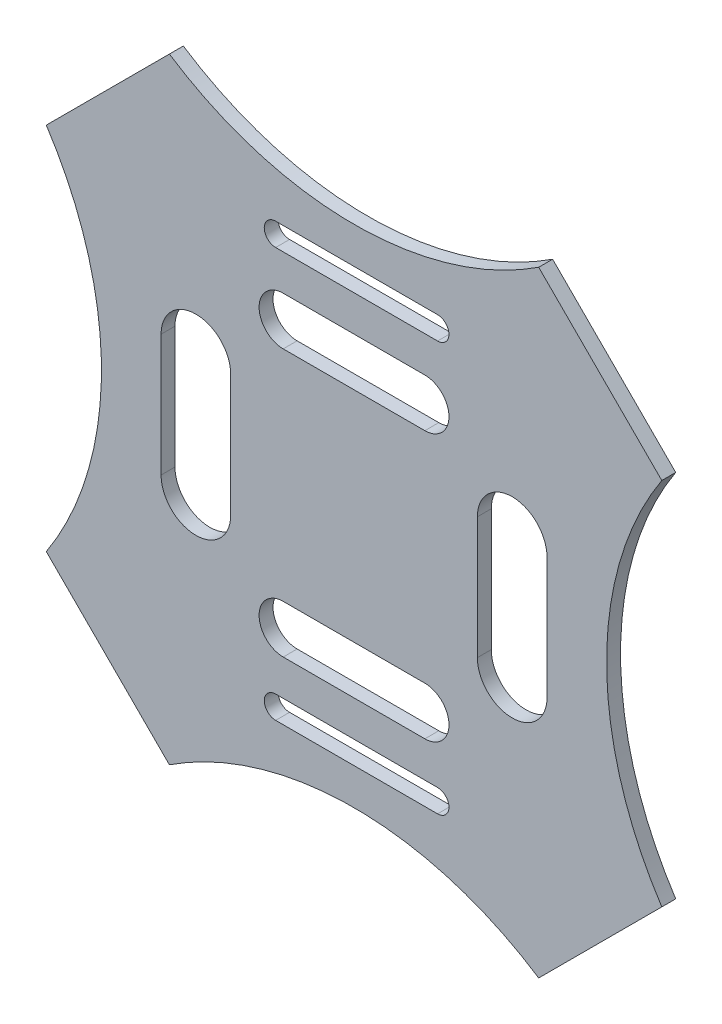
ISO-10303-21;
HEADER;
FILE_DESCRIPTION(('STEP AP214'),'2;1');
FILE_NAME('part.step','',(''),(''),'','','');
FILE_SCHEMA(('AUTOMOTIVE_DESIGN { 1 0 10303 214 1 1 1 1 }'));
ENDSEC;
DATA;
#1=APPLICATION_CONTEXT('core data for automotive mechanical design processes');
#2=APPLICATION_PROTOCOL_DEFINITION('international standard','automotive_design',2000,#1);
#3=PRODUCT_CONTEXT('',#1,'mechanical');
#4=PRODUCT('Part','Part','',(#3));
#5=PRODUCT_RELATED_PRODUCT_CATEGORY('part','',(#4));
#6=PRODUCT_DEFINITION_FORMATION('','',#4);
#7=PRODUCT_DEFINITION_CONTEXT('part definition',#1,'design');
#8=PRODUCT_DEFINITION('design','',#6,#7);
#9=PRODUCT_DEFINITION_SHAPE('','',#8);
#10=(LENGTH_UNIT() NAMED_UNIT(*) SI_UNIT(.MILLI.,.METRE.));
#11=(NAMED_UNIT(*) PLANE_ANGLE_UNIT() SI_UNIT($,.RADIAN.));
#12=(NAMED_UNIT(*) SI_UNIT($,.STERADIAN.) SOLID_ANGLE_UNIT());
#13=UNCERTAINTY_MEASURE_WITH_UNIT(LENGTH_MEASURE(1.E-05),#10,'distance_accuracy_value','');
#14=(GEOMETRIC_REPRESENTATION_CONTEXT(3) GLOBAL_UNCERTAINTY_ASSIGNED_CONTEXT((#13)) GLOBAL_UNIT_ASSIGNED_CONTEXT((#10,
#11,#12)) REPRESENTATION_CONTEXT('',''));
#15=CARTESIAN_POINT('',(0.,0.,0.));
#16=DIRECTION('',(0.,0.,1.));
#17=DIRECTION('',(1.,0.,0.));
#18=AXIS2_PLACEMENT_3D('',#15,#16,#17);
#19=CARTESIAN_POINT('',(0.,84.5998532410874,2.));
#20=DIRECTION('',(0.,0.,-1.));
#21=DIRECTION('',(-1.,0.,0.));
#22=AXIS2_PLACEMENT_3D('',#19,#20,#21);
#23=CYLINDRICAL_SURFACE('',#22,48.3295347499184);
#24=CARTESIAN_POINT('',(0.,84.5998532410874,0.));
#25=DIRECTION('',(0.,0.,1.));
#26=DIRECTION('',(1.,0.,0.));
#27=AXIS2_PLACEMENT_3D('',#24,#25,#26);
#28=CIRCLE('',#27,48.3295347499184);
#29=CARTESIAN_POINT('',(-26.5165042944955,44.1941738241592,0.));
#30=VERTEX_POINT('',#29);
#31=CARTESIAN_POINT('',(26.5165042944955,44.1941738241592,0.));
#32=VERTEX_POINT('',#31);
#33=EDGE_CURVE('E427',#30,#32,#28,.T.);
#34=ORIENTED_EDGE('',*,*,#33,.F.);
#35=DIRECTION('',(0.,0.,-1.));
#36=VECTOR('',#35,1.);
#37=CARTESIAN_POINT('',(-26.5165042944955,44.1941738241592,2.));
#38=LINE('',#37,#36);
#39=CARTESIAN_POINT('',(-26.5165042944955,44.1941738241592,2.));
#40=VERTEX_POINT('',#39);
#41=EDGE_CURVE('E11',#40,#30,#38,.T.);
#42=ORIENTED_EDGE('',*,*,#41,.F.);
#43=CARTESIAN_POINT('',(0.,84.5998532410874,2.));
#44=DIRECTION('',(0.,0.,1.));
#45=DIRECTION('',(1.,0.,0.));
#46=AXIS2_PLACEMENT_3D('',#43,#44,#45);
#47=CIRCLE('',#46,48.3295347499184);
#48=CARTESIAN_POINT('',(26.5165042944955,44.1941738241592,2.));
#49=VERTEX_POINT('',#48);
#50=EDGE_CURVE('E428',#40,#49,#47,.T.);
#51=ORIENTED_EDGE('',*,*,#50,.T.);
#52=DIRECTION('',(0.,0.,-1.));
#53=VECTOR('',#52,1.);
#54=CARTESIAN_POINT('',(26.5165042944955,44.1941738241592,2.));
#55=LINE('',#54,#53);
#56=EDGE_CURVE('E449',#49,#32,#55,.T.);
#57=ORIENTED_EDGE('',*,*,#56,.T.);
#58=EDGE_LOOP('',(#34,#42,#51,#57));
#59=FACE_BOUND('',#58,.T.);
#60=ADVANCED_FACE('F40',(#59),#23,.F.);
#61=CARTESIAN_POINT('',(-35.3553390593274,35.3553390593274,2.));
#62=DIRECTION('',(0.707106781186548,-0.707106781186547,0.));
#63=DIRECTION('',(0.707106781186547,0.707106781186548,0.));
#64=AXIS2_PLACEMENT_3D('',#61,#62,#63);
#65=PLANE('',#64);
#66=DIRECTION('',(-0.707106781186547,-0.707106781186548,0.));
#67=VECTOR('',#66,1.);
#68=CARTESIAN_POINT('',(-35.3553390593274,35.3553390593274,0.));
#69=LINE('',#68,#67);
#70=CARTESIAN_POINT('',(-44.1941738241592,26.5165042944955,0.));
#71=VERTEX_POINT('',#70);
#72=EDGE_CURVE('E452',#30,#71,#69,.T.);
#73=ORIENTED_EDGE('',*,*,#72,.T.);
#74=DIRECTION('',(0.,0.,-1.));
#75=VECTOR('',#74,1.);
#76=CARTESIAN_POINT('',(-44.1941738241592,26.5165042944955,2.));
#77=LINE('',#76,#75);
#78=CARTESIAN_POINT('',(-44.1941738241592,26.5165042944955,2.));
#79=VERTEX_POINT('',#78);
#80=EDGE_CURVE('E47',#79,#71,#77,.T.);
#81=ORIENTED_EDGE('',*,*,#80,.F.);
#82=DIRECTION('',(-0.707106781186547,-0.707106781186548,0.));
#83=VECTOR('',#82,1.);
#84=CARTESIAN_POINT('',(-35.3553390593274,35.3553390593274,2.));
#85=LINE('',#84,#83);
#86=EDGE_CURVE('E431',#40,#79,#85,.T.);
#87=ORIENTED_EDGE('',*,*,#86,.F.);
#88=ORIENTED_EDGE('',*,*,#41,.T.);
#89=EDGE_LOOP('',(#73,#81,#87,#88));
#90=FACE_BOUND('',#89,.T.);
#91=ADVANCED_FACE('F505',(#90),#65,.F.);
#92=CARTESIAN_POINT('',(-84.5998532410874,0.,2.));
#93=DIRECTION('',(0.,0.,-1.));
#94=DIRECTION('',(-1.,0.,0.));
#95=AXIS2_PLACEMENT_3D('',#92,#93,#94);
#96=CYLINDRICAL_SURFACE('',#95,48.3295347499185);
#97=CARTESIAN_POINT('',(-84.5998532410874,0.,0.));
#98=DIRECTION('',(0.,0.,1.));
#99=DIRECTION('',(1.,0.,0.));
#100=AXIS2_PLACEMENT_3D('',#97,#98,#99);
#101=CIRCLE('',#100,48.3295347499185);
#102=CARTESIAN_POINT('',(-44.1941738241592,-26.5165042944955,0.));
#103=VERTEX_POINT('',#102);
#104=EDGE_CURVE('E454',#71,#103,#101,.F.);
#105=ORIENTED_EDGE('',*,*,#104,.T.);
#106=DIRECTION('',(0.,0.,-1.));
#107=VECTOR('',#106,1.);
#108=CARTESIAN_POINT('',(-44.1941738241592,-26.5165042944955,2.));
#109=LINE('',#108,#107);
#110=CARTESIAN_POINT('',(-44.1941738241592,-26.5165042944955,2.));
#111=VERTEX_POINT('',#110);
#112=EDGE_CURVE('E480',#111,#103,#109,.T.);
#113=ORIENTED_EDGE('',*,*,#112,.F.);
#114=CARTESIAN_POINT('',(-84.5998532410874,0.,2.));
#115=DIRECTION('',(0.,0.,1.));
#116=DIRECTION('',(1.,0.,0.));
#117=AXIS2_PLACEMENT_3D('',#114,#115,#116);
#118=CIRCLE('',#117,48.3295347499185);
#119=EDGE_CURVE('E434',#79,#111,#118,.F.);
#120=ORIENTED_EDGE('',*,*,#119,.F.);
#121=ORIENTED_EDGE('',*,*,#80,.T.);
#122=EDGE_LOOP('',(#105,#113,#120,#121));
#123=FACE_BOUND('',#122,.T.);
#124=ADVANCED_FACE('F486',(#123),#96,.F.);
#125=CARTESIAN_POINT('',(-35.3553390593274,-35.3553390593274,2.));
#126=DIRECTION('',(-0.707106781186547,-0.707106781186548,0.));
#127=DIRECTION('',(0.707106781186548,-0.707106781186547,0.));
#128=AXIS2_PLACEMENT_3D('',#125,#126,#127);
#129=PLANE('',#128);
#130=DIRECTION('',(-0.707106781186548,0.707106781186547,0.));
#131=VECTOR('',#130,1.);
#132=CARTESIAN_POINT('',(-35.3553390593274,-35.3553390593274,0.));
#133=LINE('',#132,#131);
#134=CARTESIAN_POINT('',(-26.5165042944955,-44.1941738241592,0.));
#135=VERTEX_POINT('',#134);
#136=EDGE_CURVE('E457',#135,#103,#133,.T.);
#137=ORIENTED_EDGE('',*,*,#136,.F.);
#138=DIRECTION('',(0.,0.,-1.));
#139=VECTOR('',#138,1.);
#140=CARTESIAN_POINT('',(-26.5165042944955,-44.1941738241592,2.));
#141=LINE('',#140,#139);
#142=CARTESIAN_POINT('',(-26.5165042944955,-44.1941738241592,2.));
#143=VERTEX_POINT('',#142);
#144=EDGE_CURVE('E478',#143,#135,#141,.T.);
#145=ORIENTED_EDGE('',*,*,#144,.F.);
#146=DIRECTION('',(-0.707106781186548,0.707106781186547,0.));
#147=VECTOR('',#146,1.);
#148=CARTESIAN_POINT('',(-35.3553390593274,-35.3553390593274,2.));
#149=LINE('',#148,#147);
#150=EDGE_CURVE('E436',#143,#111,#149,.T.);
#151=ORIENTED_EDGE('',*,*,#150,.T.);
#152=ORIENTED_EDGE('',*,*,#112,.T.);
#153=EDGE_LOOP('',(#137,#145,#151,#152));
#154=FACE_BOUND('',#153,.T.);
#155=ADVANCED_FACE('F497',(#154),#129,.T.);
#156=CARTESIAN_POINT('',(0.,-84.5998532410874,2.));
#157=DIRECTION('',(0.,0.,-1.));
#158=DIRECTION('',(-1.,0.,0.));
#159=AXIS2_PLACEMENT_3D('',#156,#157,#158);
#160=CYLINDRICAL_SURFACE('',#159,48.3295347499185);
#161=CARTESIAN_POINT('',(0.,-84.5998532410874,0.));
#162=DIRECTION('',(0.,0.,1.));
#163=DIRECTION('',(1.,0.,0.));
#164=AXIS2_PLACEMENT_3D('',#161,#162,#163);
#165=CIRCLE('',#164,48.3295347499185);
#166=CARTESIAN_POINT('',(26.5165042944955,-44.1941738241592,0.));
#167=VERTEX_POINT('',#166);
#168=EDGE_CURVE('E460',#135,#167,#165,.F.);
#169=ORIENTED_EDGE('',*,*,#168,.T.);
#170=DIRECTION('',(0.,0.,-1.));
#171=VECTOR('',#170,1.);
#172=CARTESIAN_POINT('',(26.5165042944955,-44.1941738241592,2.));
#173=LINE('',#172,#171);
#174=CARTESIAN_POINT('',(26.5165042944955,-44.1941738241592,2.));
#175=VERTEX_POINT('',#174);
#176=EDGE_CURVE('E475',#175,#167,#173,.T.);
#177=ORIENTED_EDGE('',*,*,#176,.F.);
#178=CARTESIAN_POINT('',(0.,-84.5998532410874,2.));
#179=DIRECTION('',(0.,0.,1.));
#180=DIRECTION('',(1.,0.,0.));
#181=AXIS2_PLACEMENT_3D('',#178,#179,#180);
#182=CIRCLE('',#181,48.3295347499185);
#183=EDGE_CURVE('E439',#143,#175,#182,.F.);
#184=ORIENTED_EDGE('',*,*,#183,.F.);
#185=ORIENTED_EDGE('',*,*,#144,.T.);
#186=EDGE_LOOP('',(#169,#177,#184,#185));
#187=FACE_BOUND('',#186,.T.);
#188=ADVANCED_FACE('F519',(#187),#160,.F.);
#189=CARTESIAN_POINT('',(35.3553390593274,-35.3553390593274,2.));
#190=DIRECTION('',(-0.707106781186548,0.707106781186547,0.));
#191=DIRECTION('',(-0.707106781186547,-0.707106781186548,0.));
#192=AXIS2_PLACEMENT_3D('',#189,#190,#191);
#193=PLANE('',#192);
#194=DIRECTION('',(0.707106781186547,0.707106781186548,0.));
#195=VECTOR('',#194,1.);
#196=CARTESIAN_POINT('',(35.3553390593274,-35.3553390593274,0.));
#197=LINE('',#196,#195);
#198=CARTESIAN_POINT('',(44.1941738241592,-26.5165042944955,0.));
#199=VERTEX_POINT('',#198);
#200=EDGE_CURVE('E462',#167,#199,#197,.T.);
#201=ORIENTED_EDGE('',*,*,#200,.T.);
#202=DIRECTION('',(0.,0.,-1.));
#203=VECTOR('',#202,1.);
#204=CARTESIAN_POINT('',(44.1941738241592,-26.5165042944955,2.));
#205=LINE('',#204,#203);
#206=CARTESIAN_POINT('',(44.1941738241592,-26.5165042944955,2.));
#207=VERTEX_POINT('',#206);
#208=EDGE_CURVE('E473',#207,#199,#205,.T.);
#209=ORIENTED_EDGE('',*,*,#208,.F.);
#210=DIRECTION('',(0.707106781186547,0.707106781186548,0.));
#211=VECTOR('',#210,1.);
#212=CARTESIAN_POINT('',(35.3553390593274,-35.3553390593274,2.));
#213=LINE('',#212,#211);
#214=EDGE_CURVE('E441',#175,#207,#213,.T.);
#215=ORIENTED_EDGE('',*,*,#214,.F.);
#216=ORIENTED_EDGE('',*,*,#176,.T.);
#217=EDGE_LOOP('',(#201,#209,#215,#216));
#218=FACE_BOUND('',#217,.T.);
#219=ADVANCED_FACE('F516',(#218),#193,.F.);
#220=CARTESIAN_POINT('',(84.5998532410874,0.,2.));
#221=DIRECTION('',(0.,0.,-1.));
#222=DIRECTION('',(-1.,0.,0.));
#223=AXIS2_PLACEMENT_3D('',#220,#221,#222);
#224=CYLINDRICAL_SURFACE('',#223,48.3295347499184);
#225=CARTESIAN_POINT('',(84.5998532410874,0.,0.));
#226=DIRECTION('',(0.,0.,1.));
#227=DIRECTION('',(1.,0.,0.));
#228=AXIS2_PLACEMENT_3D('',#225,#226,#227);
#229=CIRCLE('',#228,48.3295347499184);
#230=CARTESIAN_POINT('',(44.1941738241592,26.5165042944956,0.));
#231=VERTEX_POINT('',#230);
#232=EDGE_CURVE('E465',#231,#199,#229,.T.);
#233=ORIENTED_EDGE('',*,*,#232,.F.);
#234=DIRECTION('',(0.,0.,-1.));
#235=VECTOR('',#234,1.);
#236=CARTESIAN_POINT('',(44.1941738241592,26.5165042944956,2.));
#237=LINE('',#236,#235);
#238=CARTESIAN_POINT('',(44.1941738241592,26.5165042944956,2.));
#239=VERTEX_POINT('',#238);
#240=EDGE_CURVE('E471',#239,#231,#237,.T.);
#241=ORIENTED_EDGE('',*,*,#240,.F.);
#242=CARTESIAN_POINT('',(84.5998532410874,0.,2.));
#243=DIRECTION('',(0.,0.,1.));
#244=DIRECTION('',(1.,0.,0.));
#245=AXIS2_PLACEMENT_3D('',#242,#243,#244);
#246=CIRCLE('',#245,48.3295347499184);
#247=EDGE_CURVE('E443',#239,#207,#246,.T.);
#248=ORIENTED_EDGE('',*,*,#247,.T.);
#249=ORIENTED_EDGE('',*,*,#208,.T.);
#250=EDGE_LOOP('',(#233,#241,#248,#249));
#251=FACE_BOUND('',#250,.T.);
#252=ADVANCED_FACE('F513',(#251),#224,.F.);
#253=CARTESIAN_POINT('',(35.3553390593274,35.3553390593274,2.));
#254=DIRECTION('',(0.707106781186547,0.707106781186548,0.));
#255=DIRECTION('',(-0.707106781186548,0.707106781186547,0.));
#256=AXIS2_PLACEMENT_3D('',#253,#254,#255);
#257=PLANE('',#256);
#258=DIRECTION('',(0.707106781186548,-0.707106781186547,0.));
#259=VECTOR('',#258,1.);
#260=CARTESIAN_POINT('',(35.3553390593274,35.3553390593274,0.));
#261=LINE('',#260,#259);
#262=EDGE_CURVE('E432',#32,#231,#261,.T.);
#263=ORIENTED_EDGE('',*,*,#262,.F.);
#264=ORIENTED_EDGE('',*,*,#56,.F.);
#265=DIRECTION('',(0.707106781186548,-0.707106781186547,0.));
#266=VECTOR('',#265,1.);
#267=CARTESIAN_POINT('',(35.3553390593274,35.3553390593274,2.));
#268=LINE('',#267,#266);
#269=EDGE_CURVE('E446',#49,#239,#268,.T.);
#270=ORIENTED_EDGE('',*,*,#269,.T.);
#271=ORIENTED_EDGE('',*,*,#240,.T.);
#272=EDGE_LOOP('',(#263,#264,#270,#271));
#273=FACE_BOUND('',#272,.T.);
#274=ADVANCED_FACE('F509',(#273),#257,.T.);
#275=CARTESIAN_POINT('',(0.,0.,2.));
#276=DIRECTION('',(0.,0.,1.));
#277=DIRECTION('',(1.,0.,0.));
#278=AXIS2_PLACEMENT_3D('',#275,#276,#277);
#279=PLANE('',#278);
#280=CARTESIAN_POINT('',(11.9939289647254,-29.4023943991028,2.));
#281=DIRECTION('',(0.,0.,1.));
#282=DIRECTION('',(1.,0.,0.));
#283=AXIS2_PLACEMENT_3D('',#280,#281,#282);
#284=CIRCLE('',#283,1.63743450039893);
#285=CARTESIAN_POINT('',(11.9939289647254,-31.0398288995017,2.));
#286=VERTEX_POINT('',#285);
#287=CARTESIAN_POINT('',(11.9939289647254,-27.7649598987039,2.));
#288=VERTEX_POINT('',#287);
#289=EDGE_CURVE('E280',#286,#288,#284,.T.);
#290=ORIENTED_EDGE('',*,*,#289,.F.);
#291=DIRECTION('',(1.,0.,0.));
#292=VECTOR('',#291,1.);
#293=CARTESIAN_POINT('',(0.,-31.0398288995017,2.));
#294=LINE('',#293,#292);
#295=CARTESIAN_POINT('',(-11.2563574939603,-31.0398288995017,2.));
#296=VERTEX_POINT('',#295);
#297=EDGE_CURVE('E273',#296,#286,#294,.T.);
#298=ORIENTED_EDGE('',*,*,#297,.F.);
#299=CARTESIAN_POINT('',(-11.2563574939603,-29.4023943991028,2.));
#300=DIRECTION('',(0.,0.,1.));
#301=DIRECTION('',(1.,0.,0.));
#302=AXIS2_PLACEMENT_3D('',#299,#300,#301);
#303=CIRCLE('',#302,1.63743450039893);
#304=CARTESIAN_POINT('',(-11.2563574939603,-27.7649598987039,2.));
#305=VERTEX_POINT('',#304);
#306=EDGE_CURVE('E253',#305,#296,#303,.T.);
#307=ORIENTED_EDGE('',*,*,#306,.F.);
#308=DIRECTION('',(-1.,0.,0.));
#309=VECTOR('',#308,1.);
#310=CARTESIAN_POINT('',(0.,-27.7649598987039,2.));
#311=LINE('',#310,#309);
#312=EDGE_CURVE('E278',#288,#305,#311,.T.);
#313=ORIENTED_EDGE('',*,*,#312,.F.);
#314=EDGE_LOOP('',(#290,#298,#307,#313));
#315=FACE_BOUND('',#314,.T.);
#316=CARTESIAN_POINT('',(10.1716423481787,-19.1609914473721,2.));
#317=DIRECTION('',(0.,0.,1.));
#318=DIRECTION('',(1.,0.,0.));
#319=AXIS2_PLACEMENT_3D('',#316,#317,#318);
#320=CIRCLE('',#319,3.4597211169456);
#321=CARTESIAN_POINT('',(10.1716423481787,-22.6207125643177,2.));
#322=VERTEX_POINT('',#321);
#323=CARTESIAN_POINT('',(10.1716423481787,-15.7012703304265,2.));
#324=VERTEX_POINT('',#323);
#325=EDGE_CURVE('E309',#322,#324,#320,.T.);
#326=ORIENTED_EDGE('',*,*,#325,.F.);
#327=DIRECTION('',(1.,0.,0.));
#328=VECTOR('',#327,1.);
#329=CARTESIAN_POINT('',(0.,-22.6207125643177,2.));
#330=LINE('',#329,#328);
#331=CARTESIAN_POINT('',(-10.1716423481788,-22.6207125643177,2.));
#332=VERTEX_POINT('',#331);
#333=EDGE_CURVE('E296',#332,#322,#330,.T.);
#334=ORIENTED_EDGE('',*,*,#333,.F.);
#335=CARTESIAN_POINT('',(-10.1716423481788,-19.1609914473721,2.));
#336=DIRECTION('',(0.,0.,1.));
#337=DIRECTION('',(1.,0.,0.));
#338=AXIS2_PLACEMENT_3D('',#335,#336,#337);
#339=CIRCLE('',#338,3.4597211169456);
#340=CARTESIAN_POINT('',(-10.1716423481788,-15.7012703304265,2.));
#341=VERTEX_POINT('',#340);
#342=EDGE_CURVE('E304',#341,#332,#339,.T.);
#343=ORIENTED_EDGE('',*,*,#342,.F.);
#344=DIRECTION('',(-1.,0.,0.));
#345=VECTOR('',#344,1.);
#346=CARTESIAN_POINT('',(0.,-15.7012703304265,2.));
#347=LINE('',#346,#345);
#348=EDGE_CURVE('E307',#324,#341,#347,.T.);
#349=ORIENTED_EDGE('',*,*,#348,.F.);
#350=EDGE_LOOP('',(#326,#334,#343,#349));
#351=FACE_BOUND('',#350,.T.);
#352=CARTESIAN_POINT('',(11.9939289647254,29.4023943991028,2.));
#353=DIRECTION('',(0.,0.,1.));
#354=DIRECTION('',(1.,0.,0.));
#355=AXIS2_PLACEMENT_3D('',#352,#353,#354);
#356=CIRCLE('',#355,1.63743450039893);
#357=CARTESIAN_POINT('',(11.9939289647254,27.7649598987039,2.));
#358=VERTEX_POINT('',#357);
#359=CARTESIAN_POINT('',(11.9939289647254,31.0398288995017,2.));
#360=VERTEX_POINT('',#359);
#361=EDGE_CURVE('E338',#358,#360,#356,.T.);
#362=ORIENTED_EDGE('',*,*,#361,.F.);
#363=DIRECTION('',(1.,0.,0.));
#364=VECTOR('',#363,1.);
#365=CARTESIAN_POINT('',(0.,27.7649598987039,2.));
#366=LINE('',#365,#364);
#367=CARTESIAN_POINT('',(-11.2563574939603,27.7649598987039,2.));
#368=VERTEX_POINT('',#367);
#369=EDGE_CURVE('E325',#368,#358,#366,.T.);
#370=ORIENTED_EDGE('',*,*,#369,.F.);
#371=CARTESIAN_POINT('',(-11.2563574939603,29.4023943991028,2.));
#372=DIRECTION('',(0.,0.,1.));
#373=DIRECTION('',(1.,0.,0.));
#374=AXIS2_PLACEMENT_3D('',#371,#372,#373);
#375=CIRCLE('',#374,1.63743450039893);
#376=CARTESIAN_POINT('',(-11.2563574939603,31.0398288995017,2.));
#377=VERTEX_POINT('',#376);
#378=EDGE_CURVE('E333',#377,#368,#375,.T.);
#379=ORIENTED_EDGE('',*,*,#378,.F.);
#380=DIRECTION('',(-1.,0.,0.));
#381=VECTOR('',#380,1.);
#382=CARTESIAN_POINT('',(0.,31.0398288995017,2.));
#383=LINE('',#382,#381);
#384=EDGE_CURVE('E336',#360,#377,#383,.T.);
#385=ORIENTED_EDGE('',*,*,#384,.F.);
#386=EDGE_LOOP('',(#362,#370,#379,#385));
#387=FACE_BOUND('',#386,.T.);
#388=CARTESIAN_POINT('',(10.1716423481787,19.1609914473721,2.));
#389=DIRECTION('',(0.,0.,1.));
#390=DIRECTION('',(1.,0.,0.));
#391=AXIS2_PLACEMENT_3D('',#388,#389,#390);
#392=CIRCLE('',#391,3.4597211169456);
#393=CARTESIAN_POINT('',(10.1716423481787,15.7012703304265,2.));
#394=VERTEX_POINT('',#393);
#395=CARTESIAN_POINT('',(10.1716423481787,22.6207125643177,2.));
#396=VERTEX_POINT('',#395);
#397=EDGE_CURVE('E367',#394,#396,#392,.T.);
#398=ORIENTED_EDGE('',*,*,#397,.F.);
#399=DIRECTION('',(1.,0.,0.));
#400=VECTOR('',#399,1.);
#401=CARTESIAN_POINT('',(0.,15.7012703304265,2.));
#402=LINE('',#401,#400);
#403=CARTESIAN_POINT('',(-10.1716423481788,15.7012703304265,2.));
#404=VERTEX_POINT('',#403);
#405=EDGE_CURVE('E354',#404,#394,#402,.T.);
#406=ORIENTED_EDGE('',*,*,#405,.F.);
#407=CARTESIAN_POINT('',(-10.1716423481788,19.1609914473721,2.));
#408=DIRECTION('',(0.,0.,1.));
#409=DIRECTION('',(1.,0.,0.));
#410=AXIS2_PLACEMENT_3D('',#407,#408,#409);
#411=CIRCLE('',#410,3.4597211169456);
#412=CARTESIAN_POINT('',(-10.1716423481788,22.6207125643177,2.));
#413=VERTEX_POINT('',#412);
#414=EDGE_CURVE('E362',#413,#404,#411,.T.);
#415=ORIENTED_EDGE('',*,*,#414,.F.);
#416=DIRECTION('',(-1.,0.,0.));
#417=VECTOR('',#416,1.);
#418=CARTESIAN_POINT('',(0.,22.6207125643177,2.));
#419=LINE('',#418,#417);
#420=EDGE_CURVE('E365',#396,#413,#419,.T.);
#421=ORIENTED_EDGE('',*,*,#420,.F.);
#422=EDGE_LOOP('',(#398,#406,#415,#421));
#423=FACE_BOUND('',#422,.T.);
#424=CARTESIAN_POINT('',(-22.7087565006061,-8.75750726125976,2.));
#425=DIRECTION('',(0.,0.,1.));
#426=DIRECTION('',(1.,0.,0.));
#427=AXIS2_PLACEMENT_3D('',#424,#425,#426);
#428=CIRCLE('',#427,5.);
#429=CARTESIAN_POINT('',(-27.7087565006062,-8.75750726125975,2.));
#430=VERTEX_POINT('',#429);
#431=CARTESIAN_POINT('',(-17.7087565006062,-8.75750726125976,2.));
#432=VERTEX_POINT('',#431);
#433=EDGE_CURVE('E396',#430,#432,#428,.T.);
#434=ORIENTED_EDGE('',*,*,#433,.F.);
#435=DIRECTION('',(0.,-1.,0.));
#436=VECTOR('',#435,1.);
#437=CARTESIAN_POINT('',(-27.7087565006062,0.,2.));
#438=LINE('',#437,#436);
#439=CARTESIAN_POINT('',(-27.7087565006062,8.75750726125975,2.));
#440=VERTEX_POINT('',#439);
#441=EDGE_CURVE('E383',#440,#430,#438,.T.);
#442=ORIENTED_EDGE('',*,*,#441,.F.);
#443=CARTESIAN_POINT('',(-22.7087565006061,8.75750726125976,2.));
#444=DIRECTION('',(0.,0.,1.));
#445=DIRECTION('',(1.,0.,0.));
#446=AXIS2_PLACEMENT_3D('',#443,#444,#445);
#447=CIRCLE('',#446,5.);
#448=CARTESIAN_POINT('',(-17.7087565006061,8.75750726125976,2.));
#449=VERTEX_POINT('',#448);
#450=EDGE_CURVE('E391',#449,#440,#447,.T.);
#451=ORIENTED_EDGE('',*,*,#450,.F.);
#452=DIRECTION('',(0.,1.,0.));
#453=VECTOR('',#452,1.);
#454=CARTESIAN_POINT('',(-17.7087565006062,0.,2.));
#455=LINE('',#454,#453);
#456=EDGE_CURVE('E394',#432,#449,#455,.T.);
#457=ORIENTED_EDGE('',*,*,#456,.F.);
#458=EDGE_LOOP('',(#434,#442,#451,#457));
#459=FACE_BOUND('',#458,.T.);
#460=CARTESIAN_POINT('',(22.7087565006061,-8.75750726125976,2.));
#461=DIRECTION('',(0.,0.,1.));
#462=DIRECTION('',(1.,0.,0.));
#463=AXIS2_PLACEMENT_3D('',#460,#461,#462);
#464=CIRCLE('',#463,4.99999999999999);
#465=CARTESIAN_POINT('',(17.7087565006061,-8.75750726125977,2.));
#466=VERTEX_POINT('',#465);
#467=CARTESIAN_POINT('',(27.7087565006061,-8.75750726125975,2.));
#468=VERTEX_POINT('',#467);
#469=EDGE_CURVE('E425',#466,#468,#464,.T.);
#470=ORIENTED_EDGE('',*,*,#469,.F.);
#471=DIRECTION('',(0.,-1.,0.));
#472=VECTOR('',#471,1.);
#473=CARTESIAN_POINT('',(17.7087565006061,0.,2.));
#474=LINE('',#473,#472);
#475=CARTESIAN_POINT('',(17.7087565006061,8.75750726125977,2.));
#476=VERTEX_POINT('',#475);
#477=EDGE_CURVE('E412',#476,#466,#474,.T.);
#478=ORIENTED_EDGE('',*,*,#477,.F.);
#479=CARTESIAN_POINT('',(22.7087565006061,8.75750726125976,2.));
#480=DIRECTION('',(0.,0.,1.));
#481=DIRECTION('',(1.,0.,0.));
#482=AXIS2_PLACEMENT_3D('',#479,#480,#481);
#483=CIRCLE('',#482,4.99999999999999);
#484=CARTESIAN_POINT('',(27.7087565006061,8.75750726125975,2.));
#485=VERTEX_POINT('',#484);
#486=EDGE_CURVE('E420',#485,#476,#483,.T.);
#487=ORIENTED_EDGE('',*,*,#486,.F.);
#488=DIRECTION('',(0.,1.,0.));
#489=VECTOR('',#488,1.);
#490=CARTESIAN_POINT('',(27.7087565006061,0.,2.));
#491=LINE('',#490,#489);
#492=EDGE_CURVE('E423',#468,#485,#491,.T.);
#493=ORIENTED_EDGE('',*,*,#492,.F.);
#494=EDGE_LOOP('',(#470,#478,#487,#493));
#495=FACE_BOUND('',#494,.T.);
#496=ORIENTED_EDGE('',*,*,#50,.F.);
#497=ORIENTED_EDGE('',*,*,#86,.T.);
#498=ORIENTED_EDGE('',*,*,#119,.T.);
#499=ORIENTED_EDGE('',*,*,#150,.F.);
#500=ORIENTED_EDGE('',*,*,#183,.T.);
#501=ORIENTED_EDGE('',*,*,#214,.T.);
#502=ORIENTED_EDGE('',*,*,#247,.F.);
#503=ORIENTED_EDGE('',*,*,#269,.F.);
#504=EDGE_LOOP('',(#496,#497,#498,#499,#500,#501,#502,#503));
#505=FACE_BOUND('',#504,.T.);
#506=ADVANCED_FACE('F502',(#315,#351,#387,#423,#459,#495,#505),#279,.T.);
#507=CARTESIAN_POINT('',(0.,0.,0.));
#508=DIRECTION('',(0.,0.,1.));
#509=DIRECTION('',(1.,0.,0.));
#510=AXIS2_PLACEMENT_3D('',#507,#508,#509);
#511=PLANE('',#510);
#512=DIRECTION('',(-1.,0.,0.));
#513=VECTOR('',#512,1.);
#514=CARTESIAN_POINT('',(11.9939289647254,-31.0398288995017,0.));
#515=LINE('',#514,#513);
#516=CARTESIAN_POINT('',(11.9939289647254,-31.0398288995017,0.));
#517=VERTEX_POINT('',#516);
#518=CARTESIAN_POINT('',(-11.2563574939603,-31.0398288995017,0.));
#519=VERTEX_POINT('',#518);
#520=EDGE_CURVE('E259',#517,#519,#515,.T.);
#521=ORIENTED_EDGE('',*,*,#520,.F.);
#522=CARTESIAN_POINT('',(11.9939289647254,-29.4023943991028,0.));
#523=DIRECTION('',(0.,0.,-1.));
#524=DIRECTION('',(1.,0.,0.));
#525=AXIS2_PLACEMENT_3D('',#522,#523,#524);
#526=CIRCLE('',#525,1.63743450039893);
#527=CARTESIAN_POINT('',(11.9939289647254,-27.7649598987039,0.));
#528=VERTEX_POINT('',#527);
#529=EDGE_CURVE('E62',#528,#517,#526,.T.);
#530=ORIENTED_EDGE('',*,*,#529,.F.);
#531=DIRECTION('',(1.,0.,0.));
#532=VECTOR('',#531,1.);
#533=CARTESIAN_POINT('',(11.9939289647254,-27.7649598987039,0.));
#534=LINE('',#533,#532);
#535=CARTESIAN_POINT('',(-11.2563574939603,-27.7649598987039,0.));
#536=VERTEX_POINT('',#535);
#537=EDGE_CURVE('E266',#536,#528,#534,.T.);
#538=ORIENTED_EDGE('',*,*,#537,.F.);
#539=CARTESIAN_POINT('',(-11.2563574939603,-29.4023943991028,0.));
#540=DIRECTION('',(0.,0.,-1.));
#541=DIRECTION('',(1.,0.,0.));
#542=AXIS2_PLACEMENT_3D('',#539,#540,#541);
#543=CIRCLE('',#542,1.63743450039893);
#544=EDGE_CURVE('E250',#519,#536,#543,.T.);
#545=ORIENTED_EDGE('',*,*,#544,.F.);
#546=EDGE_LOOP('',(#521,#530,#538,#545));
#547=FACE_BOUND('',#546,.T.);
#548=DIRECTION('',(-1.,0.,0.));
#549=VECTOR('',#548,1.);
#550=CARTESIAN_POINT('',(10.1716423481787,-22.6207125643177,0.));
#551=LINE('',#550,#549);
#552=CARTESIAN_POINT('',(10.1716423481787,-22.6207125643177,0.));
#553=VERTEX_POINT('',#552);
#554=CARTESIAN_POINT('',(-10.1716423481788,-22.6207125643177,0.));
#555=VERTEX_POINT('',#554);
#556=EDGE_CURVE('E284',#553,#555,#551,.T.);
#557=ORIENTED_EDGE('',*,*,#556,.F.);
#558=CARTESIAN_POINT('',(10.1716423481787,-19.1609914473721,0.));
#559=DIRECTION('',(0.,0.,-1.));
#560=DIRECTION('',(1.,0.,0.));
#561=AXIS2_PLACEMENT_3D('',#558,#559,#560);
#562=CIRCLE('',#561,3.4597211169456);
#563=CARTESIAN_POINT('',(10.1716423481787,-15.7012703304265,0.));
#564=VERTEX_POINT('',#563);
#565=EDGE_CURVE('E282',#564,#553,#562,.T.);
#566=ORIENTED_EDGE('',*,*,#565,.F.);
#567=DIRECTION('',(1.,0.,0.));
#568=VECTOR('',#567,1.);
#569=CARTESIAN_POINT('',(10.1716423481787,-15.7012703304265,0.));
#570=LINE('',#569,#568);
#571=CARTESIAN_POINT('',(-10.1716423481788,-15.7012703304265,0.));
#572=VERTEX_POINT('',#571);
#573=EDGE_CURVE('E290',#572,#564,#570,.T.);
#574=ORIENTED_EDGE('',*,*,#573,.F.);
#575=CARTESIAN_POINT('',(-10.1716423481788,-19.1609914473721,0.));
#576=DIRECTION('',(0.,0.,-1.));
#577=DIRECTION('',(1.,0.,0.));
#578=AXIS2_PLACEMENT_3D('',#575,#576,#577);
#579=CIRCLE('',#578,3.4597211169456);
#580=EDGE_CURVE('E287',#555,#572,#579,.T.);
#581=ORIENTED_EDGE('',*,*,#580,.F.);
#582=EDGE_LOOP('',(#557,#566,#574,#581));
#583=FACE_BOUND('',#582,.T.);
#584=DIRECTION('',(-1.,0.,0.));
#585=VECTOR('',#584,1.);
#586=CARTESIAN_POINT('',(11.9939289647254,27.7649598987039,0.));
#587=LINE('',#586,#585);
#588=CARTESIAN_POINT('',(11.9939289647254,27.7649598987039,0.));
#589=VERTEX_POINT('',#588);
#590=CARTESIAN_POINT('',(-11.2563574939603,27.7649598987039,0.));
#591=VERTEX_POINT('',#590);
#592=EDGE_CURVE('E313',#589,#591,#587,.T.);
#593=ORIENTED_EDGE('',*,*,#592,.F.);
#594=CARTESIAN_POINT('',(11.9939289647254,29.4023943991028,0.));
#595=DIRECTION('',(0.,0.,-1.));
#596=DIRECTION('',(-1.,0.,0.));
#597=AXIS2_PLACEMENT_3D('',#594,#595,#596);
#598=CIRCLE('',#597,1.63743450039893);
#599=CARTESIAN_POINT('',(11.9939289647254,31.0398288995017,0.));
#600=VERTEX_POINT('',#599);
#601=EDGE_CURVE('E311',#600,#589,#598,.T.);
#602=ORIENTED_EDGE('',*,*,#601,.F.);
#603=DIRECTION('',(1.,0.,0.));
#604=VECTOR('',#603,1.);
#605=CARTESIAN_POINT('',(11.9939289647254,31.0398288995017,0.));
#606=LINE('',#605,#604);
#607=CARTESIAN_POINT('',(-11.2563574939603,31.0398288995017,0.));
#608=VERTEX_POINT('',#607);
#609=EDGE_CURVE('E319',#608,#600,#606,.T.);
#610=ORIENTED_EDGE('',*,*,#609,.F.);
#611=CARTESIAN_POINT('',(-11.2563574939603,29.4023943991028,0.));
#612=DIRECTION('',(0.,0.,-1.));
#613=DIRECTION('',(-1.,0.,0.));
#614=AXIS2_PLACEMENT_3D('',#611,#612,#613);
#615=CIRCLE('',#614,1.63743450039893);
#616=EDGE_CURVE('E316',#591,#608,#615,.T.);
#617=ORIENTED_EDGE('',*,*,#616,.F.);
#618=EDGE_LOOP('',(#593,#602,#610,#617));
#619=FACE_BOUND('',#618,.T.);
#620=DIRECTION('',(-1.,0.,0.));
#621=VECTOR('',#620,1.);
#622=CARTESIAN_POINT('',(10.1716423481787,15.7012703304265,0.));
#623=LINE('',#622,#621);
#624=CARTESIAN_POINT('',(10.1716423481787,15.7012703304265,0.));
#625=VERTEX_POINT('',#624);
#626=CARTESIAN_POINT('',(-10.1716423481788,15.7012703304265,0.));
#627=VERTEX_POINT('',#626);
#628=EDGE_CURVE('E342',#625,#627,#623,.T.);
#629=ORIENTED_EDGE('',*,*,#628,.F.);
#630=CARTESIAN_POINT('',(10.1716423481787,19.1609914473721,0.));
#631=DIRECTION('',(0.,0.,-1.));
#632=DIRECTION('',(-1.,0.,0.));
#633=AXIS2_PLACEMENT_3D('',#630,#631,#632);
#634=CIRCLE('',#633,3.4597211169456);
#635=CARTESIAN_POINT('',(10.1716423481787,22.6207125643177,0.));
#636=VERTEX_POINT('',#635);
#637=EDGE_CURVE('E340',#636,#625,#634,.T.);
#638=ORIENTED_EDGE('',*,*,#637,.F.);
#639=DIRECTION('',(1.,0.,0.));
#640=VECTOR('',#639,1.);
#641=CARTESIAN_POINT('',(10.1716423481787,22.6207125643177,0.));
#642=LINE('',#641,#640);
#643=CARTESIAN_POINT('',(-10.1716423481788,22.6207125643177,0.));
#644=VERTEX_POINT('',#643);
#645=EDGE_CURVE('E348',#644,#636,#642,.T.);
#646=ORIENTED_EDGE('',*,*,#645,.F.);
#647=CARTESIAN_POINT('',(-10.1716423481788,19.1609914473721,0.));
#648=DIRECTION('',(0.,0.,-1.));
#649=DIRECTION('',(-1.,0.,0.));
#650=AXIS2_PLACEMENT_3D('',#647,#648,#649);
#651=CIRCLE('',#650,3.4597211169456);
#652=EDGE_CURVE('E345',#627,#644,#651,.T.);
#653=ORIENTED_EDGE('',*,*,#652,.F.);
#654=EDGE_LOOP('',(#629,#638,#646,#653));
#655=FACE_BOUND('',#654,.T.);
#656=DIRECTION('',(0.,1.,0.));
#657=VECTOR('',#656,1.);
#658=CARTESIAN_POINT('',(-27.7087565006062,-8.75750726125975,0.));
#659=LINE('',#658,#657);
#660=CARTESIAN_POINT('',(-27.7087565006062,-8.75750726125975,0.));
#661=VERTEX_POINT('',#660);
#662=CARTESIAN_POINT('',(-27.7087565006062,8.75750726125975,0.));
#663=VERTEX_POINT('',#662);
#664=EDGE_CURVE('E371',#661,#663,#659,.T.);
#665=ORIENTED_EDGE('',*,*,#664,.F.);
#666=CARTESIAN_POINT('',(-22.7087565006061,-8.75750726125976,0.));
#667=DIRECTION('',(0.,0.,-1.));
#668=DIRECTION('',(1.,0.,0.));
#669=AXIS2_PLACEMENT_3D('',#666,#667,#668);
#670=CIRCLE('',#669,5.);
#671=CARTESIAN_POINT('',(-17.7087565006062,-8.75750726125976,0.));
#672=VERTEX_POINT('',#671);
#673=EDGE_CURVE('E369',#672,#661,#670,.T.);
#674=ORIENTED_EDGE('',*,*,#673,.F.);
#675=DIRECTION('',(0.,-1.,0.));
#676=VECTOR('',#675,1.);
#677=CARTESIAN_POINT('',(-17.7087565006062,-8.75750726125976,0.));
#678=LINE('',#677,#676);
#679=CARTESIAN_POINT('',(-17.7087565006061,8.75750726125976,0.));
#680=VERTEX_POINT('',#679);
#681=EDGE_CURVE('E377',#680,#672,#678,.T.);
#682=ORIENTED_EDGE('',*,*,#681,.F.);
#683=CARTESIAN_POINT('',(-22.7087565006061,8.75750726125976,0.));
#684=DIRECTION('',(0.,0.,-1.));
#685=DIRECTION('',(1.,0.,0.));
#686=AXIS2_PLACEMENT_3D('',#683,#684,#685);
#687=CIRCLE('',#686,5.);
#688=EDGE_CURVE('E374',#663,#680,#687,.T.);
#689=ORIENTED_EDGE('',*,*,#688,.F.);
#690=EDGE_LOOP('',(#665,#674,#682,#689));
#691=FACE_BOUND('',#690,.T.);
#692=DIRECTION('',(0.,1.,0.));
#693=VECTOR('',#692,1.);
#694=CARTESIAN_POINT('',(17.7087565006061,-8.75750726125977,0.));
#695=LINE('',#694,#693);
#696=CARTESIAN_POINT('',(17.7087565006061,-8.75750726125977,0.));
#697=VERTEX_POINT('',#696);
#698=CARTESIAN_POINT('',(17.7087565006061,8.75750726125977,0.));
#699=VERTEX_POINT('',#698);
#700=EDGE_CURVE('E400',#697,#699,#695,.T.);
#701=ORIENTED_EDGE('',*,*,#700,.F.);
#702=CARTESIAN_POINT('',(22.7087565006061,-8.75750726125976,0.));
#703=DIRECTION('',(0.,0.,-1.));
#704=DIRECTION('',(-1.,0.,0.));
#705=AXIS2_PLACEMENT_3D('',#702,#703,#704);
#706=CIRCLE('',#705,4.99999999999999);
#707=CARTESIAN_POINT('',(27.7087565006061,-8.75750726125975,0.));
#708=VERTEX_POINT('',#707);
#709=EDGE_CURVE('E398',#708,#697,#706,.T.);
#710=ORIENTED_EDGE('',*,*,#709,.F.);
#711=DIRECTION('',(0.,-1.,0.));
#712=VECTOR('',#711,1.);
#713=CARTESIAN_POINT('',(27.7087565006061,-8.75750726125975,0.));
#714=LINE('',#713,#712);
#715=CARTESIAN_POINT('',(27.7087565006061,8.75750726125975,0.));
#716=VERTEX_POINT('',#715);
#717=EDGE_CURVE('E406',#716,#708,#714,.T.);
#718=ORIENTED_EDGE('',*,*,#717,.F.);
#719=CARTESIAN_POINT('',(22.7087565006061,8.75750726125976,0.));
#720=DIRECTION('',(0.,0.,-1.));
#721=DIRECTION('',(-1.,0.,0.));
#722=AXIS2_PLACEMENT_3D('',#719,#720,#721);
#723=CIRCLE('',#722,4.99999999999999);
#724=EDGE_CURVE('E403',#699,#716,#723,.T.);
#725=ORIENTED_EDGE('',*,*,#724,.F.);
#726=EDGE_LOOP('',(#701,#710,#718,#725));
#727=FACE_BOUND('',#726,.T.);
#728=ORIENTED_EDGE('',*,*,#33,.T.);
#729=ORIENTED_EDGE('',*,*,#262,.T.);
#730=ORIENTED_EDGE('',*,*,#232,.T.);
#731=ORIENTED_EDGE('',*,*,#200,.F.);
#732=ORIENTED_EDGE('',*,*,#168,.F.);
#733=ORIENTED_EDGE('',*,*,#136,.T.);
#734=ORIENTED_EDGE('',*,*,#104,.F.);
#735=ORIENTED_EDGE('',*,*,#72,.F.);
#736=EDGE_LOOP('',(#728,#729,#730,#731,#732,#733,#734,#735));
#737=FACE_BOUND('',#736,.T.);
#738=ADVANCED_FACE('F263',(#547,#583,#619,#655,#691,#727,#737),#511,.F.);
#739=CARTESIAN_POINT('',(22.7087565006061,-8.75750726125976,10.));
#740=DIRECTION('',(0.,0.,-1.));
#741=DIRECTION('',(-1.,0.,0.));
#742=AXIS2_PLACEMENT_3D('',#739,#740,#741);
#743=CYLINDRICAL_SURFACE('',#742,4.99999999999999);
#744=ORIENTED_EDGE('',*,*,#469,.T.);
#745=DIRECTION('',(0.,0.,-1.));
#746=VECTOR('',#745,1.);
#747=CARTESIAN_POINT('',(27.7087565006061,-8.75750726125975,10.));
#748=LINE('',#747,#746);
#749=EDGE_CURVE('E410',#468,#708,#748,.T.);
#750=ORIENTED_EDGE('',*,*,#749,.T.);
#751=ORIENTED_EDGE('',*,*,#709,.T.);
#752=DIRECTION('',(0.,0.,-1.));
#753=VECTOR('',#752,1.);
#754=CARTESIAN_POINT('',(17.7087565006061,-8.75750726125977,10.));
#755=LINE('',#754,#753);
#756=EDGE_CURVE('E409',#466,#697,#755,.T.);
#757=ORIENTED_EDGE('',*,*,#756,.F.);
#758=EDGE_LOOP('',(#744,#750,#751,#757));
#759=FACE_BOUND('',#758,.T.);
#760=ADVANCED_FACE('F586',(#759),#743,.F.);
#761=CARTESIAN_POINT('',(27.7087565006061,-8.75750726125975,10.));
#762=DIRECTION('',(1.,0.,0.));
#763=DIRECTION('',(0.,0.,-1.));
#764=AXIS2_PLACEMENT_3D('',#761,#762,#763);
#765=PLANE('',#764);
#766=ORIENTED_EDGE('',*,*,#492,.T.);
#767=DIRECTION('',(0.,0.,-1.));
#768=VECTOR('',#767,1.);
#769=CARTESIAN_POINT('',(27.7087565006061,8.75750726125975,10.));
#770=LINE('',#769,#768);
#771=EDGE_CURVE('E413',#485,#716,#770,.T.);
#772=ORIENTED_EDGE('',*,*,#771,.T.);
#773=ORIENTED_EDGE('',*,*,#717,.T.);
#774=ORIENTED_EDGE('',*,*,#749,.F.);
#775=EDGE_LOOP('',(#766,#772,#773,#774));
#776=FACE_BOUND('',#775,.T.);
#777=ADVANCED_FACE('F595',(#776),#765,.F.);
#778=CARTESIAN_POINT('',(22.7087565006061,8.75750726125976,10.));
#779=DIRECTION('',(0.,0.,-1.));
#780=DIRECTION('',(-1.,0.,0.));
#781=AXIS2_PLACEMENT_3D('',#778,#779,#780);
#782=CYLINDRICAL_SURFACE('',#781,4.99999999999999);
#783=ORIENTED_EDGE('',*,*,#486,.T.);
#784=DIRECTION('',(0.,0.,-1.));
#785=VECTOR('',#784,1.);
#786=CARTESIAN_POINT('',(17.7087565006061,8.75750726125977,10.));
#787=LINE('',#786,#785);
#788=EDGE_CURVE('E415',#476,#699,#787,.T.);
#789=ORIENTED_EDGE('',*,*,#788,.T.);
#790=ORIENTED_EDGE('',*,*,#724,.T.);
#791=ORIENTED_EDGE('',*,*,#771,.F.);
#792=EDGE_LOOP('',(#783,#789,#790,#791));
#793=FACE_BOUND('',#792,.T.);
#794=ADVANCED_FACE('F605',(#793),#782,.F.);
#795=CARTESIAN_POINT('',(17.7087565006061,-8.75750726125977,10.));
#796=DIRECTION('',(-1.,0.,0.));
#797=DIRECTION('',(0.,0.,1.));
#798=AXIS2_PLACEMENT_3D('',#795,#796,#797);
#799=PLANE('',#798);
#800=ORIENTED_EDGE('',*,*,#477,.T.);
#801=ORIENTED_EDGE('',*,*,#756,.T.);
#802=ORIENTED_EDGE('',*,*,#700,.T.);
#803=ORIENTED_EDGE('',*,*,#788,.F.);
#804=EDGE_LOOP('',(#800,#801,#802,#803));
#805=FACE_BOUND('',#804,.T.);
#806=ADVANCED_FACE('F615',(#805),#799,.F.);
#807=CARTESIAN_POINT('',(-22.7087565006061,-8.75750726125976,10.));
#808=DIRECTION('',(0.,0.,-1.));
#809=DIRECTION('',(-1.,0.,0.));
#810=AXIS2_PLACEMENT_3D('',#807,#808,#809);
#811=CYLINDRICAL_SURFACE('',#810,5.);
#812=ORIENTED_EDGE('',*,*,#433,.T.);
#813=DIRECTION('',(0.,0.,-1.));
#814=VECTOR('',#813,1.);
#815=CARTESIAN_POINT('',(-17.7087565006062,-8.75750726125976,10.));
#816=LINE('',#815,#814);
#817=EDGE_CURVE('E381',#432,#672,#816,.T.);
#818=ORIENTED_EDGE('',*,*,#817,.T.);
#819=ORIENTED_EDGE('',*,*,#673,.T.);
#820=DIRECTION('',(0.,0.,-1.));
#821=VECTOR('',#820,1.);
#822=CARTESIAN_POINT('',(-27.7087565006062,-8.75750726125975,10.));
#823=LINE('',#822,#821);
#824=EDGE_CURVE('E380',#430,#661,#823,.T.);
#825=ORIENTED_EDGE('',*,*,#824,.F.);
#826=EDGE_LOOP('',(#812,#818,#819,#825));
#827=FACE_BOUND('',#826,.T.);
#828=ADVANCED_FACE('F625',(#827),#811,.F.);
#829=CARTESIAN_POINT('',(-17.7087565006062,-8.75750726125976,10.));
#830=DIRECTION('',(1.,0.,0.));
#831=DIRECTION('',(0.,0.,-1.));
#832=AXIS2_PLACEMENT_3D('',#829,#830,#831);
#833=PLANE('',#832);
#834=ORIENTED_EDGE('',*,*,#456,.T.);
#835=DIRECTION('',(0.,0.,-1.));
#836=VECTOR('',#835,1.);
#837=CARTESIAN_POINT('',(-17.7087565006061,8.75750726125976,10.));
#838=LINE('',#837,#836);
#839=EDGE_CURVE('E384',#449,#680,#838,.T.);
#840=ORIENTED_EDGE('',*,*,#839,.T.);
#841=ORIENTED_EDGE('',*,*,#681,.T.);
#842=ORIENTED_EDGE('',*,*,#817,.F.);
#843=EDGE_LOOP('',(#834,#840,#841,#842));
#844=FACE_BOUND('',#843,.T.);
#845=ADVANCED_FACE('F635',(#844),#833,.F.);
#846=CARTESIAN_POINT('',(-22.7087565006061,8.75750726125976,10.));
#847=DIRECTION('',(0.,0.,-1.));
#848=DIRECTION('',(-1.,0.,0.));
#849=AXIS2_PLACEMENT_3D('',#846,#847,#848);
#850=CYLINDRICAL_SURFACE('',#849,5.);
#851=ORIENTED_EDGE('',*,*,#450,.T.);
#852=DIRECTION('',(0.,0.,-1.));
#853=VECTOR('',#852,1.);
#854=CARTESIAN_POINT('',(-27.7087565006062,8.75750726125975,10.));
#855=LINE('',#854,#853);
#856=EDGE_CURVE('E386',#440,#663,#855,.T.);
#857=ORIENTED_EDGE('',*,*,#856,.T.);
#858=ORIENTED_EDGE('',*,*,#688,.T.);
#859=ORIENTED_EDGE('',*,*,#839,.F.);
#860=EDGE_LOOP('',(#851,#857,#858,#859));
#861=FACE_BOUND('',#860,.T.);
#862=ADVANCED_FACE('F645',(#861),#850,.F.);
#863=CARTESIAN_POINT('',(-27.7087565006062,-8.75750726125975,10.));
#864=DIRECTION('',(-1.,0.,0.));
#865=DIRECTION('',(0.,0.,1.));
#866=AXIS2_PLACEMENT_3D('',#863,#864,#865);
#867=PLANE('',#866);
#868=ORIENTED_EDGE('',*,*,#441,.T.);
#869=ORIENTED_EDGE('',*,*,#824,.T.);
#870=ORIENTED_EDGE('',*,*,#664,.T.);
#871=ORIENTED_EDGE('',*,*,#856,.F.);
#872=EDGE_LOOP('',(#868,#869,#870,#871));
#873=FACE_BOUND('',#872,.T.);
#874=ADVANCED_FACE('F655',(#873),#867,.F.);
#875=CARTESIAN_POINT('',(10.1716423481787,19.1609914473721,10.));
#876=DIRECTION('',(0.,0.,-1.));
#877=DIRECTION('',(-1.,0.,0.));
#878=AXIS2_PLACEMENT_3D('',#875,#876,#877);
#879=CYLINDRICAL_SURFACE('',#878,3.4597211169456);
#880=ORIENTED_EDGE('',*,*,#397,.T.);
#881=DIRECTION('',(0.,0.,-1.));
#882=VECTOR('',#881,1.);
#883=CARTESIAN_POINT('',(10.1716423481787,22.6207125643177,10.));
#884=LINE('',#883,#882);
#885=EDGE_CURVE('E352',#396,#636,#884,.T.);
#886=ORIENTED_EDGE('',*,*,#885,.T.);
#887=ORIENTED_EDGE('',*,*,#637,.T.);
#888=DIRECTION('',(0.,0.,-1.));
#889=VECTOR('',#888,1.);
#890=CARTESIAN_POINT('',(10.1716423481787,15.7012703304265,10.));
#891=LINE('',#890,#889);
#892=EDGE_CURVE('E351',#394,#625,#891,.T.);
#893=ORIENTED_EDGE('',*,*,#892,.F.);
#894=EDGE_LOOP('',(#880,#886,#887,#893));
#895=FACE_BOUND('',#894,.T.);
#896=ADVANCED_FACE('F665',(#895),#879,.F.);
#897=CARTESIAN_POINT('',(10.1716423481787,22.6207125643177,10.));
#898=DIRECTION('',(0.,1.,0.));
#899=DIRECTION('',(0.,0.,1.));
#900=AXIS2_PLACEMENT_3D('',#897,#898,#899);
#901=PLANE('',#900);
#902=ORIENTED_EDGE('',*,*,#420,.T.);
#903=DIRECTION('',(0.,0.,-1.));
#904=VECTOR('',#903,1.);
#905=CARTESIAN_POINT('',(-10.1716423481788,22.6207125643177,10.));
#906=LINE('',#905,#904);
#907=EDGE_CURVE('E355',#413,#644,#906,.T.);
#908=ORIENTED_EDGE('',*,*,#907,.T.);
#909=ORIENTED_EDGE('',*,*,#645,.T.);
#910=ORIENTED_EDGE('',*,*,#885,.F.);
#911=EDGE_LOOP('',(#902,#908,#909,#910));
#912=FACE_BOUND('',#911,.T.);
#913=ADVANCED_FACE('F675',(#912),#901,.F.);
#914=CARTESIAN_POINT('',(-10.1716423481788,19.1609914473721,10.));
#915=DIRECTION('',(0.,0.,-1.));
#916=DIRECTION('',(-1.,0.,0.));
#917=AXIS2_PLACEMENT_3D('',#914,#915,#916);
#918=CYLINDRICAL_SURFACE('',#917,3.4597211169456);
#919=ORIENTED_EDGE('',*,*,#414,.T.);
#920=DIRECTION('',(0.,0.,-1.));
#921=VECTOR('',#920,1.);
#922=CARTESIAN_POINT('',(-10.1716423481788,15.7012703304265,10.));
#923=LINE('',#922,#921);
#924=EDGE_CURVE('E357',#404,#627,#923,.T.);
#925=ORIENTED_EDGE('',*,*,#924,.T.);
#926=ORIENTED_EDGE('',*,*,#652,.T.);
#927=ORIENTED_EDGE('',*,*,#907,.F.);
#928=EDGE_LOOP('',(#919,#925,#926,#927));
#929=FACE_BOUND('',#928,.T.);
#930=ADVANCED_FACE('F685',(#929),#918,.F.);
#931=CARTESIAN_POINT('',(10.1716423481787,15.7012703304265,10.));
#932=DIRECTION('',(0.,-1.,0.));
#933=DIRECTION('',(0.,0.,-1.));
#934=AXIS2_PLACEMENT_3D('',#931,#932,#933);
#935=PLANE('',#934);
#936=ORIENTED_EDGE('',*,*,#405,.T.);
#937=ORIENTED_EDGE('',*,*,#892,.T.);
#938=ORIENTED_EDGE('',*,*,#628,.T.);
#939=ORIENTED_EDGE('',*,*,#924,.F.);
#940=EDGE_LOOP('',(#936,#937,#938,#939));
#941=FACE_BOUND('',#940,.T.);
#942=ADVANCED_FACE('F695',(#941),#935,.F.);
#943=CARTESIAN_POINT('',(11.9939289647254,29.4023943991028,10.));
#944=DIRECTION('',(0.,0.,-1.));
#945=DIRECTION('',(-1.,0.,0.));
#946=AXIS2_PLACEMENT_3D('',#943,#944,#945);
#947=CYLINDRICAL_SURFACE('',#946,1.63743450039893);
#948=ORIENTED_EDGE('',*,*,#361,.T.);
#949=DIRECTION('',(0.,0.,-1.));
#950=VECTOR('',#949,1.);
#951=CARTESIAN_POINT('',(11.9939289647254,31.0398288995017,10.));
#952=LINE('',#951,#950);
#953=EDGE_CURVE('E323',#360,#600,#952,.T.);
#954=ORIENTED_EDGE('',*,*,#953,.T.);
#955=ORIENTED_EDGE('',*,*,#601,.T.);
#956=DIRECTION('',(0.,0.,-1.));
#957=VECTOR('',#956,1.);
#958=CARTESIAN_POINT('',(11.9939289647254,27.7649598987039,10.));
#959=LINE('',#958,#957);
#960=EDGE_CURVE('E322',#358,#589,#959,.T.);
#961=ORIENTED_EDGE('',*,*,#960,.F.);
#962=EDGE_LOOP('',(#948,#954,#955,#961));
#963=FACE_BOUND('',#962,.T.);
#964=ADVANCED_FACE('F705',(#963),#947,.F.);
#965=CARTESIAN_POINT('',(11.9939289647254,31.0398288995017,10.));
#966=DIRECTION('',(0.,1.,0.));
#967=DIRECTION('',(0.,0.,1.));
#968=AXIS2_PLACEMENT_3D('',#965,#966,#967);
#969=PLANE('',#968);
#970=ORIENTED_EDGE('',*,*,#384,.T.);
#971=DIRECTION('',(0.,0.,-1.));
#972=VECTOR('',#971,1.);
#973=CARTESIAN_POINT('',(-11.2563574939603,31.0398288995017,10.));
#974=LINE('',#973,#972);
#975=EDGE_CURVE('E326',#377,#608,#974,.T.);
#976=ORIENTED_EDGE('',*,*,#975,.T.);
#977=ORIENTED_EDGE('',*,*,#609,.T.);
#978=ORIENTED_EDGE('',*,*,#953,.F.);
#979=EDGE_LOOP('',(#970,#976,#977,#978));
#980=FACE_BOUND('',#979,.T.);
#981=ADVANCED_FACE('F715',(#980),#969,.F.);
#982=CARTESIAN_POINT('',(-11.2563574939603,29.4023943991028,10.));
#983=DIRECTION('',(0.,0.,-1.));
#984=DIRECTION('',(-1.,0.,0.));
#985=AXIS2_PLACEMENT_3D('',#982,#983,#984);
#986=CYLINDRICAL_SURFACE('',#985,1.63743450039893);
#987=ORIENTED_EDGE('',*,*,#378,.T.);
#988=DIRECTION('',(0.,0.,-1.));
#989=VECTOR('',#988,1.);
#990=CARTESIAN_POINT('',(-11.2563574939603,27.7649598987039,10.));
#991=LINE('',#990,#989);
#992=EDGE_CURVE('E328',#368,#591,#991,.T.);
#993=ORIENTED_EDGE('',*,*,#992,.T.);
#994=ORIENTED_EDGE('',*,*,#616,.T.);
#995=ORIENTED_EDGE('',*,*,#975,.F.);
#996=EDGE_LOOP('',(#987,#993,#994,#995));
#997=FACE_BOUND('',#996,.T.);
#998=ADVANCED_FACE('F725',(#997),#986,.F.);
#999=CARTESIAN_POINT('',(11.9939289647254,27.7649598987039,10.));
#1000=DIRECTION('',(0.,-1.,0.));
#1001=DIRECTION('',(0.,0.,-1.));
#1002=AXIS2_PLACEMENT_3D('',#999,#1000,#1001);
#1003=PLANE('',#1002);
#1004=ORIENTED_EDGE('',*,*,#369,.T.);
#1005=ORIENTED_EDGE('',*,*,#960,.T.);
#1006=ORIENTED_EDGE('',*,*,#592,.T.);
#1007=ORIENTED_EDGE('',*,*,#992,.F.);
#1008=EDGE_LOOP('',(#1004,#1005,#1006,#1007));
#1009=FACE_BOUND('',#1008,.T.);
#1010=ADVANCED_FACE('F735',(#1009),#1003,.F.);
#1011=CARTESIAN_POINT('',(10.1716423481787,-19.1609914473721,10.));
#1012=DIRECTION('',(0.,0.,-1.));
#1013=DIRECTION('',(-1.,0.,0.));
#1014=AXIS2_PLACEMENT_3D('',#1011,#1012,#1013);
#1015=CYLINDRICAL_SURFACE('',#1014,3.4597211169456);
#1016=ORIENTED_EDGE('',*,*,#325,.T.);
#1017=DIRECTION('',(0.,0.,-1.));
#1018=VECTOR('',#1017,1.);
#1019=CARTESIAN_POINT('',(10.1716423481787,-15.7012703304265,10.));
#1020=LINE('',#1019,#1018);
#1021=EDGE_CURVE('E294',#324,#564,#1020,.T.);
#1022=ORIENTED_EDGE('',*,*,#1021,.T.);
#1023=ORIENTED_EDGE('',*,*,#565,.T.);
#1024=DIRECTION('',(0.,0.,-1.));
#1025=VECTOR('',#1024,1.);
#1026=CARTESIAN_POINT('',(10.1716423481787,-22.6207125643177,10.));
#1027=LINE('',#1026,#1025);
#1028=EDGE_CURVE('E293',#322,#553,#1027,.T.);
#1029=ORIENTED_EDGE('',*,*,#1028,.F.);
#1030=EDGE_LOOP('',(#1016,#1022,#1023,#1029));
#1031=FACE_BOUND('',#1030,.T.);
#1032=ADVANCED_FACE('F745',(#1031),#1015,.F.);
#1033=CARTESIAN_POINT('',(10.1716423481787,-15.7012703304265,10.));
#1034=DIRECTION('',(0.,1.,0.));
#1035=DIRECTION('',(-1.,0.,0.));
#1036=AXIS2_PLACEMENT_3D('',#1033,#1034,#1035);
#1037=PLANE('',#1036);
#1038=ORIENTED_EDGE('',*,*,#348,.T.);
#1039=DIRECTION('',(0.,0.,-1.));
#1040=VECTOR('',#1039,1.);
#1041=CARTESIAN_POINT('',(-10.1716423481788,-15.7012703304265,10.));
#1042=LINE('',#1041,#1040);
#1043=EDGE_CURVE('E297',#341,#572,#1042,.T.);
#1044=ORIENTED_EDGE('',*,*,#1043,.T.);
#1045=ORIENTED_EDGE('',*,*,#573,.T.);
#1046=ORIENTED_EDGE('',*,*,#1021,.F.);
#1047=EDGE_LOOP('',(#1038,#1044,#1045,#1046));
#1048=FACE_BOUND('',#1047,.T.);
#1049=ADVANCED_FACE('F755',(#1048),#1037,.F.);
#1050=CARTESIAN_POINT('',(-10.1716423481788,-19.1609914473721,10.));
#1051=DIRECTION('',(0.,0.,-1.));
#1052=DIRECTION('',(-1.,0.,0.));
#1053=AXIS2_PLACEMENT_3D('',#1050,#1051,#1052);
#1054=CYLINDRICAL_SURFACE('',#1053,3.4597211169456);
#1055=ORIENTED_EDGE('',*,*,#342,.T.);
#1056=DIRECTION('',(0.,0.,-1.));
#1057=VECTOR('',#1056,1.);
#1058=CARTESIAN_POINT('',(-10.1716423481788,-22.6207125643177,10.));
#1059=LINE('',#1058,#1057);
#1060=EDGE_CURVE('E299',#332,#555,#1059,.T.);
#1061=ORIENTED_EDGE('',*,*,#1060,.T.);
#1062=ORIENTED_EDGE('',*,*,#580,.T.);
#1063=ORIENTED_EDGE('',*,*,#1043,.F.);
#1064=EDGE_LOOP('',(#1055,#1061,#1062,#1063));
#1065=FACE_BOUND('',#1064,.T.);
#1066=ADVANCED_FACE('F765',(#1065),#1054,.F.);
#1067=CARTESIAN_POINT('',(10.1716423481787,-22.6207125643177,10.));
#1068=DIRECTION('',(0.,-1.,0.));
#1069=DIRECTION('',(1.,0.,0.));
#1070=AXIS2_PLACEMENT_3D('',#1067,#1068,#1069);
#1071=PLANE('',#1070);
#1072=ORIENTED_EDGE('',*,*,#333,.T.);
#1073=ORIENTED_EDGE('',*,*,#1028,.T.);
#1074=ORIENTED_EDGE('',*,*,#556,.T.);
#1075=ORIENTED_EDGE('',*,*,#1060,.F.);
#1076=EDGE_LOOP('',(#1072,#1073,#1074,#1075));
#1077=FACE_BOUND('',#1076,.T.);
#1078=ADVANCED_FACE('F775',(#1077),#1071,.F.);
#1079=CARTESIAN_POINT('',(11.9939289647254,-29.4023943991028,10.));
#1080=DIRECTION('',(0.,0.,-1.));
#1081=DIRECTION('',(-1.,0.,0.));
#1082=AXIS2_PLACEMENT_3D('',#1079,#1080,#1081);
#1083=CYLINDRICAL_SURFACE('',#1082,1.63743450039893);
#1084=ORIENTED_EDGE('',*,*,#289,.T.);
#1085=DIRECTION('',(0.,0.,-1.));
#1086=VECTOR('',#1085,1.);
#1087=CARTESIAN_POINT('',(11.9939289647254,-27.7649598987039,10.));
#1088=LINE('',#1087,#1086);
#1089=EDGE_CURVE('E271',#288,#528,#1088,.T.);
#1090=ORIENTED_EDGE('',*,*,#1089,.T.);
#1091=ORIENTED_EDGE('',*,*,#529,.T.);
#1092=DIRECTION('',(0.,0.,-1.));
#1093=VECTOR('',#1092,1.);
#1094=CARTESIAN_POINT('',(11.9939289647254,-31.0398288995017,10.));
#1095=LINE('',#1094,#1093);
#1096=EDGE_CURVE('E256',#286,#517,#1095,.T.);
#1097=ORIENTED_EDGE('',*,*,#1096,.F.);
#1098=EDGE_LOOP('',(#1084,#1090,#1091,#1097));
#1099=FACE_BOUND('',#1098,.T.);
#1100=ADVANCED_FACE('F785',(#1099),#1083,.F.);
#1101=CARTESIAN_POINT('',(11.9939289647254,-27.7649598987039,10.));
#1102=DIRECTION('',(0.,1.,0.));
#1103=DIRECTION('',(0.,0.,1.));
#1104=AXIS2_PLACEMENT_3D('',#1101,#1102,#1103);
#1105=PLANE('',#1104);
#1106=ORIENTED_EDGE('',*,*,#312,.T.);
#1107=DIRECTION('',(0.,0.,-1.));
#1108=VECTOR('',#1107,1.);
#1109=CARTESIAN_POINT('',(-11.2563574939603,-27.7649598987039,10.));
#1110=LINE('',#1109,#1108);
#1111=EDGE_CURVE('E255',#305,#536,#1110,.T.);
#1112=ORIENTED_EDGE('',*,*,#1111,.T.);
#1113=ORIENTED_EDGE('',*,*,#537,.T.);
#1114=ORIENTED_EDGE('',*,*,#1089,.F.);
#1115=EDGE_LOOP('',(#1106,#1112,#1113,#1114));
#1116=FACE_BOUND('',#1115,.T.);
#1117=ADVANCED_FACE('F795',(#1116),#1105,.F.);
#1118=CARTESIAN_POINT('',(-11.2563574939603,-29.4023943991028,10.));
#1119=DIRECTION('',(0.,0.,-1.));
#1120=DIRECTION('',(-1.,0.,0.));
#1121=AXIS2_PLACEMENT_3D('',#1118,#1119,#1120);
#1122=CYLINDRICAL_SURFACE('',#1121,1.63743450039893);
#1123=ORIENTED_EDGE('',*,*,#306,.T.);
#1124=DIRECTION('',(0.,0.,-1.));
#1125=VECTOR('',#1124,1.);
#1126=CARTESIAN_POINT('',(-11.2563574939603,-31.0398288995017,10.));
#1127=LINE('',#1126,#1125);
#1128=EDGE_CURVE('E54',#296,#519,#1127,.T.);
#1129=ORIENTED_EDGE('',*,*,#1128,.T.);
#1130=ORIENTED_EDGE('',*,*,#544,.T.);
#1131=ORIENTED_EDGE('',*,*,#1111,.F.);
#1132=EDGE_LOOP('',(#1123,#1129,#1130,#1131));
#1133=FACE_BOUND('',#1132,.T.);
#1134=ADVANCED_FACE('F247',(#1133),#1122,.F.);
#1135=CARTESIAN_POINT('',(11.9939289647254,-31.0398288995017,10.));
#1136=DIRECTION('',(0.,-1.,0.));
#1137=DIRECTION('',(0.,0.,-1.));
#1138=AXIS2_PLACEMENT_3D('',#1135,#1136,#1137);
#1139=PLANE('',#1138);
#1140=ORIENTED_EDGE('',*,*,#297,.T.);
#1141=ORIENTED_EDGE('',*,*,#1096,.T.);
#1142=ORIENTED_EDGE('',*,*,#520,.T.);
#1143=ORIENTED_EDGE('',*,*,#1128,.F.);
#1144=EDGE_LOOP('',(#1140,#1141,#1142,#1143));
#1145=FACE_BOUND('',#1144,.T.);
#1146=ADVANCED_FACE('F260',(#1145),#1139,.F.);
#1147=CLOSED_SHELL('',(#60,#91,#124,#155,#188,#219,#252,#274,#506,#738,#760,#777,#794,#806,#828,
#845,#862,#874,#896,#913,#930,#942,#964,#981,#998,#1010,#1032,#1049,#1066,#1078,#1100,#1117,
#1134,#1146));
#1148=MANIFOLD_SOLID_BREP('B2',#1147);
#1149=ADVANCED_BREP_SHAPE_REPRESENTATION('',(#18,#1148),#14);
#1150=SHAPE_DEFINITION_REPRESENTATION(#9,#1149);
ENDSEC;
END-ISO-10303-21;
